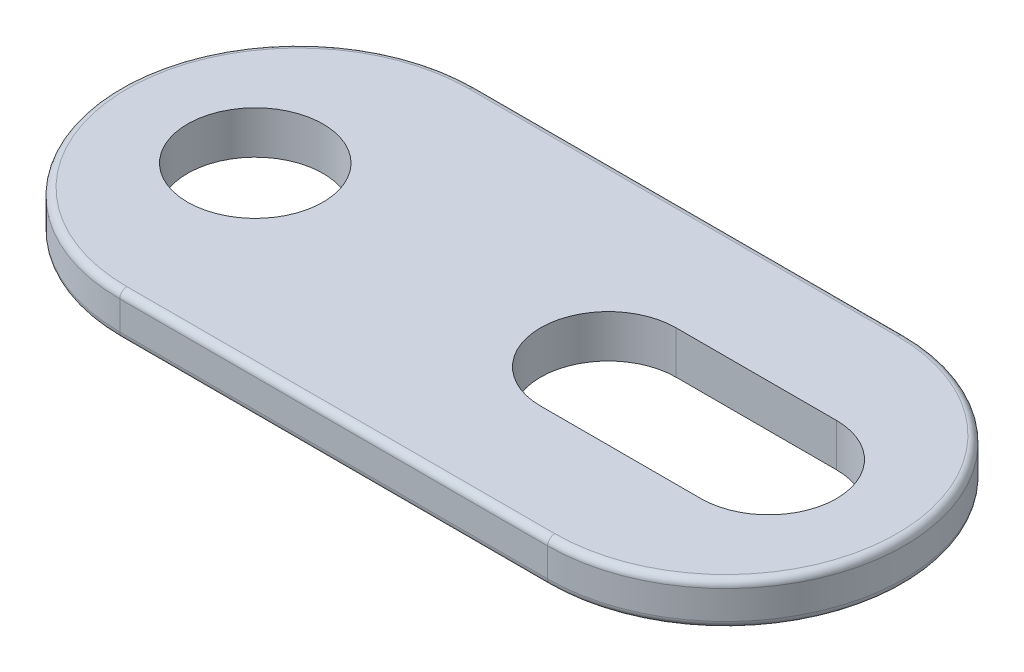
ISO-10303-21;
HEADER;
FILE_DESCRIPTION(('STEP AP214'),'2;1');
FILE_NAME('part.step','',(''),(''),'','','');
FILE_SCHEMA(('AUTOMOTIVE_DESIGN { 1 0 10303 214 1 1 1 1 }'));
ENDSEC;
DATA;
#1=APPLICATION_CONTEXT('core data for automotive mechanical design processes');
#2=APPLICATION_PROTOCOL_DEFINITION('international standard','automotive_design',2000,#1);
#3=PRODUCT_CONTEXT('',#1,'mechanical');
#4=PRODUCT('Part','Part','',(#3));
#5=PRODUCT_RELATED_PRODUCT_CATEGORY('part','',(#4));
#6=PRODUCT_DEFINITION_FORMATION('','',#4);
#7=PRODUCT_DEFINITION_CONTEXT('part definition',#1,'design');
#8=PRODUCT_DEFINITION('design','',#6,#7);
#9=PRODUCT_DEFINITION_SHAPE('','',#8);
#10=(LENGTH_UNIT() NAMED_UNIT(*) SI_UNIT(.MILLI.,.METRE.));
#11=(NAMED_UNIT(*) PLANE_ANGLE_UNIT() SI_UNIT($,.RADIAN.));
#12=(NAMED_UNIT(*) SI_UNIT($,.STERADIAN.) SOLID_ANGLE_UNIT());
#13=UNCERTAINTY_MEASURE_WITH_UNIT(LENGTH_MEASURE(1.E-05),#10,'distance_accuracy_value','');
#14=(GEOMETRIC_REPRESENTATION_CONTEXT(3) GLOBAL_UNCERTAINTY_ASSIGNED_CONTEXT((#13)) GLOBAL_UNIT_ASSIGNED_CONTEXT((#10,
#11,#12)) REPRESENTATION_CONTEXT('',''));
#15=CARTESIAN_POINT('',(0.,0.,0.));
#16=DIRECTION('',(0.,0.,1.));
#17=DIRECTION('',(1.,0.,0.));
#18=AXIS2_PLACEMENT_3D('',#15,#16,#17);
#19=CARTESIAN_POINT('',(1.524,0.762,0.));
#20=DIRECTION('',(0.,1.,0.));
#21=DIRECTION('',(0.,0.,1.));
#22=AXIS2_PLACEMENT_3D('',#19,#20,#21);
#23=PLANE('',#22);
#24=DIRECTION('',(-1.,0.,0.));
#25=VECTOR('',#24,1.);
#26=CARTESIAN_POINT('',(1.524,0.762,-6.096));
#27=LINE('',#26,#25);
#28=CARTESIAN_POINT('',(16.764,0.762,-6.096));
#29=VERTEX_POINT('',#28);
#30=CARTESIAN_POINT('',(1.524,0.762,-6.096));
#31=VERTEX_POINT('',#30);
#32=EDGE_CURVE('E53',#29,#31,#27,.T.);
#33=ORIENTED_EDGE('',*,*,#32,.T.);
#34=CARTESIAN_POINT('',(1.524,0.762,0.));
#35=DIRECTION('',(0.,1.,0.));
#36=DIRECTION('',(0.,0.,1.));
#37=AXIS2_PLACEMENT_3D('',#34,#35,#36);
#38=CIRCLE('',#37,6.096);
#39=CARTESIAN_POINT('',(1.524,0.762,6.096));
#40=VERTEX_POINT('',#39);
#41=EDGE_CURVE('E218',#31,#40,#38,.T.);
#42=ORIENTED_EDGE('',*,*,#41,.T.);
#43=DIRECTION('',(1.,0.,0.));
#44=VECTOR('',#43,1.);
#45=CARTESIAN_POINT('',(16.764,0.762,6.096));
#46=LINE('',#45,#44);
#47=CARTESIAN_POINT('',(16.764,0.762,6.096));
#48=VERTEX_POINT('',#47);
#49=EDGE_CURVE('E214',#40,#48,#46,.T.);
#50=ORIENTED_EDGE('',*,*,#49,.T.);
#51=CARTESIAN_POINT('',(16.764,0.762,0.));
#52=DIRECTION('',(0.,1.,0.));
#53=DIRECTION('',(0.,0.,1.));
#54=AXIS2_PLACEMENT_3D('',#51,#52,#53);
#55=CIRCLE('',#54,6.096);
#56=EDGE_CURVE('E58',#48,#29,#55,.T.);
#57=ORIENTED_EDGE('',*,*,#56,.T.);
#58=EDGE_LOOP('',(#33,#42,#50,#57));
#59=FACE_BOUND('',#58,.T.);
#60=CARTESIAN_POINT('',(0.,0.762,0.));
#61=DIRECTION('',(0.,1.,0.));
#62=DIRECTION('',(0.,0.,1.));
#63=AXIS2_PLACEMENT_3D('',#60,#61,#62);
#64=CIRCLE('',#63,2.413);
#65=CARTESIAN_POINT('',(0.,0.762,2.413));
#66=VERTEX_POINT('',#65);
#67=EDGE_CURVE('E176',#66,#66,#64,.T.);
#68=ORIENTED_EDGE('',*,*,#67,.F.);
#69=EDGE_LOOP('',(#68));
#70=FACE_BOUND('',#69,.T.);
#71=DIRECTION('',(1.,0.,0.));
#72=VECTOR('',#71,1.);
#73=CARTESIAN_POINT('',(12.573,0.762,2.413));
#74=LINE('',#73,#72);
#75=CARTESIAN_POINT('',(12.573,0.762,2.413));
#76=VERTEX_POINT('',#75);
#77=CARTESIAN_POINT('',(18.288,0.762,2.413));
#78=VERTEX_POINT('',#77);
#79=EDGE_CURVE('E162',#76,#78,#74,.T.);
#80=ORIENTED_EDGE('',*,*,#79,.F.);
#81=CARTESIAN_POINT('',(12.573,0.762,0.));
#82=DIRECTION('',(0.,1.,0.));
#83=DIRECTION('',(0.,0.,1.));
#84=AXIS2_PLACEMENT_3D('',#81,#82,#83);
#85=CIRCLE('',#84,2.413);
#86=CARTESIAN_POINT('',(12.573,0.762,-2.413));
#87=VERTEX_POINT('',#86);
#88=EDGE_CURVE('E145',#87,#76,#85,.T.);
#89=ORIENTED_EDGE('',*,*,#88,.F.);
#90=DIRECTION('',(-1.,0.,0.));
#91=VECTOR('',#90,1.);
#92=CARTESIAN_POINT('',(12.573,0.762,-2.413));
#93=LINE('',#92,#91);
#94=CARTESIAN_POINT('',(18.288,0.762,-2.413));
#95=VERTEX_POINT('',#94);
#96=EDGE_CURVE('E167',#95,#87,#93,.T.);
#97=ORIENTED_EDGE('',*,*,#96,.F.);
#98=CARTESIAN_POINT('',(18.288,0.762,0.));
#99=DIRECTION('',(0.,1.,0.));
#100=DIRECTION('',(0.,0.,1.));
#101=AXIS2_PLACEMENT_3D('',#98,#99,#100);
#102=CIRCLE('',#101,2.413);
#103=EDGE_CURVE('E164',#78,#95,#102,.T.);
#104=ORIENTED_EDGE('',*,*,#103,.F.);
#105=EDGE_LOOP('',(#80,#89,#97,#104));
#106=FACE_BOUND('',#105,.T.);
#107=ADVANCED_FACE('F38',(#59,#70,#106),#23,.T.);
#108=CARTESIAN_POINT('',(1.524,-0.762,0.));
#109=DIRECTION('',(0.,1.,0.));
#110=DIRECTION('',(0.,0.,1.));
#111=AXIS2_PLACEMENT_3D('',#108,#109,#110);
#112=PLANE('',#111);
#113=DIRECTION('',(1.,0.,0.));
#114=VECTOR('',#113,1.);
#115=CARTESIAN_POINT('',(1.524,-0.762,6.096));
#116=LINE('',#115,#114);
#117=CARTESIAN_POINT('',(16.764,-0.762,6.096));
#118=VERTEX_POINT('',#117);
#119=CARTESIAN_POINT('',(1.524,-0.762,6.096));
#120=VERTEX_POINT('',#119);
#121=EDGE_CURVE('E197',#118,#120,#116,.F.);
#122=ORIENTED_EDGE('',*,*,#121,.T.);
#123=CARTESIAN_POINT('',(1.524,-0.762,0.));
#124=DIRECTION('',(0.,1.,0.));
#125=DIRECTION('',(0.,0.,1.));
#126=AXIS2_PLACEMENT_3D('',#123,#124,#125);
#127=CIRCLE('',#126,6.096);
#128=CARTESIAN_POINT('',(1.524,-0.762,-6.096));
#129=VERTEX_POINT('',#128);
#130=EDGE_CURVE('E203',#120,#129,#127,.F.);
#131=ORIENTED_EDGE('',*,*,#130,.T.);
#132=DIRECTION('',(-1.,0.,0.));
#133=VECTOR('',#132,1.);
#134=CARTESIAN_POINT('',(1.524,-0.762,-6.096));
#135=LINE('',#134,#133);
#136=CARTESIAN_POINT('',(16.764,-0.762,-6.096));
#137=VERTEX_POINT('',#136);
#138=EDGE_CURVE('E201',#129,#137,#135,.F.);
#139=ORIENTED_EDGE('',*,*,#138,.T.);
#140=CARTESIAN_POINT('',(16.764,-0.762,0.));
#141=DIRECTION('',(0.,1.,0.));
#142=DIRECTION('',(0.,0.,1.));
#143=AXIS2_PLACEMENT_3D('',#140,#141,#142);
#144=CIRCLE('',#143,6.096);
#145=EDGE_CURVE('E199',#137,#118,#144,.F.);
#146=ORIENTED_EDGE('',*,*,#145,.T.);
#147=EDGE_LOOP('',(#122,#131,#139,#146));
#148=FACE_BOUND('',#147,.T.);
#149=CARTESIAN_POINT('',(0.,-0.762,0.));
#150=DIRECTION('',(0.,1.,0.));
#151=DIRECTION('',(0.,0.,1.));
#152=AXIS2_PLACEMENT_3D('',#149,#150,#151);
#153=CIRCLE('',#152,2.413);
#154=CARTESIAN_POINT('',(0.,-0.762,2.413));
#155=VERTEX_POINT('',#154);
#156=EDGE_CURVE('E146',#155,#155,#153,.T.);
#157=ORIENTED_EDGE('',*,*,#156,.T.);
#158=EDGE_LOOP('',(#157));
#159=FACE_BOUND('',#158,.T.);
#160=CARTESIAN_POINT('',(12.573,-0.762,0.));
#161=DIRECTION('',(0.,1.,0.));
#162=DIRECTION('',(0.,0.,1.));
#163=AXIS2_PLACEMENT_3D('',#160,#161,#162);
#164=CIRCLE('',#163,2.413);
#165=CARTESIAN_POINT('',(12.573,-0.762,-2.413));
#166=VERTEX_POINT('',#165);
#167=CARTESIAN_POINT('',(12.573,-0.762,2.413));
#168=VERTEX_POINT('',#167);
#169=EDGE_CURVE('E138',#166,#168,#164,.T.);
#170=ORIENTED_EDGE('',*,*,#169,.T.);
#171=DIRECTION('',(1.,0.,0.));
#172=VECTOR('',#171,1.);
#173=CARTESIAN_POINT('',(12.573,-0.762,2.413));
#174=LINE('',#173,#172);
#175=CARTESIAN_POINT('',(18.288,-0.762,2.413));
#176=VERTEX_POINT('',#175);
#177=EDGE_CURVE('E126',#168,#176,#174,.T.);
#178=ORIENTED_EDGE('',*,*,#177,.T.);
#179=CARTESIAN_POINT('',(18.288,-0.762,0.));
#180=DIRECTION('',(0.,1.,0.));
#181=DIRECTION('',(0.,0.,1.));
#182=AXIS2_PLACEMENT_3D('',#179,#180,#181);
#183=CIRCLE('',#182,2.413);
#184=CARTESIAN_POINT('',(18.288,-0.762,-2.413));
#185=VERTEX_POINT('',#184);
#186=EDGE_CURVE('E137',#176,#185,#183,.T.);
#187=ORIENTED_EDGE('',*,*,#186,.T.);
#188=DIRECTION('',(-1.,0.,0.));
#189=VECTOR('',#188,1.);
#190=CARTESIAN_POINT('',(12.573,-0.762,-2.413));
#191=LINE('',#190,#189);
#192=EDGE_CURVE('E151',#185,#166,#191,.T.);
#193=ORIENTED_EDGE('',*,*,#192,.T.);
#194=EDGE_LOOP('',(#170,#178,#187,#193));
#195=FACE_BOUND('',#194,.T.);
#196=ADVANCED_FACE('F149',(#148,#159,#195),#112,.F.);
#197=CARTESIAN_POINT('',(1.524,0.762,0.));
#198=DIRECTION('',(0.,-1.,0.));
#199=DIRECTION('',(0.,0.,-1.));
#200=AXIS2_PLACEMENT_3D('',#197,#198,#199);
#201=CYLINDRICAL_SURFACE('',#200,6.35);
#202=DIRECTION('',(0.,-1.,0.));
#203=VECTOR('',#202,1.);
#204=CARTESIAN_POINT('',(1.524,0.762,-6.35));
#205=LINE('',#204,#203);
#206=CARTESIAN_POINT('',(1.524,0.508,-6.35));
#207=VERTEX_POINT('',#206);
#208=CARTESIAN_POINT('',(1.524,-0.507999999999999,-6.35));
#209=VERTEX_POINT('',#208);
#210=EDGE_CURVE('E179',#207,#209,#205,.T.);
#211=ORIENTED_EDGE('',*,*,#210,.T.);
#212=CARTESIAN_POINT('',(1.524,-0.508,0.));
#213=DIRECTION('',(0.,1.,0.));
#214=DIRECTION('',(0.,0.,1.));
#215=AXIS2_PLACEMENT_3D('',#212,#213,#214);
#216=CIRCLE('',#215,6.35);
#217=CARTESIAN_POINT('',(1.524,-0.507999999999999,6.35));
#218=VERTEX_POINT('',#217);
#219=EDGE_CURVE('E194',#209,#218,#216,.T.);
#220=ORIENTED_EDGE('',*,*,#219,.T.);
#221=DIRECTION('',(0.,-1.,0.));
#222=VECTOR('',#221,1.);
#223=CARTESIAN_POINT('',(1.524,0.762,6.35));
#224=LINE('',#223,#222);
#225=CARTESIAN_POINT('',(1.524,0.508,6.35));
#226=VERTEX_POINT('',#225);
#227=EDGE_CURVE('E188',#226,#218,#224,.T.);
#228=ORIENTED_EDGE('',*,*,#227,.F.);
#229=CARTESIAN_POINT('',(1.524,0.508,0.));
#230=DIRECTION('',(0.,1.,0.));
#231=DIRECTION('',(0.,0.,1.));
#232=AXIS2_PLACEMENT_3D('',#229,#230,#231);
#233=CIRCLE('',#232,6.35);
#234=EDGE_CURVE('E191',#226,#207,#233,.F.);
#235=ORIENTED_EDGE('',*,*,#234,.T.);
#236=EDGE_LOOP('',(#211,#220,#228,#235));
#237=FACE_BOUND('',#236,.T.);
#238=ADVANCED_FACE('F40',(#237),#201,.T.);
#239=CARTESIAN_POINT('',(1.524,0.762,6.35));
#240=DIRECTION('',(0.,0.,-1.));
#241=DIRECTION('',(-1.,0.,0.));
#242=AXIS2_PLACEMENT_3D('',#239,#240,#241);
#243=PLANE('',#242);
#244=ORIENTED_EDGE('',*,*,#227,.T.);
#245=DIRECTION('',(1.,0.,0.));
#246=VECTOR('',#245,1.);
#247=CARTESIAN_POINT('',(1.524,-0.508,6.35));
#248=LINE('',#247,#246);
#249=CARTESIAN_POINT('',(16.764,-0.507999999999999,6.35));
#250=VERTEX_POINT('',#249);
#251=EDGE_CURVE('E11',#218,#250,#248,.T.);
#252=ORIENTED_EDGE('',*,*,#251,.T.);
#253=DIRECTION('',(0.,-1.,0.));
#254=VECTOR('',#253,1.);
#255=CARTESIAN_POINT('',(16.764,0.762,6.35));
#256=LINE('',#255,#254);
#257=CARTESIAN_POINT('',(16.764,0.508,6.35));
#258=VERTEX_POINT('',#257);
#259=EDGE_CURVE('E185',#258,#250,#256,.T.);
#260=ORIENTED_EDGE('',*,*,#259,.F.);
#261=DIRECTION('',(1.,0.,0.));
#262=VECTOR('',#261,1.);
#263=CARTESIAN_POINT('',(1.524,0.508,6.35));
#264=LINE('',#263,#262);
#265=EDGE_CURVE('E46',#258,#226,#264,.F.);
#266=ORIENTED_EDGE('',*,*,#265,.T.);
#267=EDGE_LOOP('',(#244,#252,#260,#266));
#268=FACE_BOUND('',#267,.T.);
#269=ADVANCED_FACE('F223',(#268),#243,.F.);
#270=CARTESIAN_POINT('',(16.764,0.762,0.));
#271=DIRECTION('',(0.,-1.,0.));
#272=DIRECTION('',(0.,0.,-1.));
#273=AXIS2_PLACEMENT_3D('',#270,#271,#272);
#274=CYLINDRICAL_SURFACE('',#273,6.35);
#275=ORIENTED_EDGE('',*,*,#259,.T.);
#276=CARTESIAN_POINT('',(16.764,-0.508,0.));
#277=DIRECTION('',(0.,1.,0.));
#278=DIRECTION('',(0.,0.,1.));
#279=AXIS2_PLACEMENT_3D('',#276,#277,#278);
#280=CIRCLE('',#279,6.35);
#281=CARTESIAN_POINT('',(16.764,-0.507999999999999,-6.35));
#282=VERTEX_POINT('',#281);
#283=EDGE_CURVE('E212',#250,#282,#280,.T.);
#284=ORIENTED_EDGE('',*,*,#283,.T.);
#285=DIRECTION('',(0.,-1.,0.));
#286=VECTOR('',#285,1.);
#287=CARTESIAN_POINT('',(16.764,0.762,-6.35));
#288=LINE('',#287,#286);
#289=CARTESIAN_POINT('',(16.764,0.508,-6.35));
#290=VERTEX_POINT('',#289);
#291=EDGE_CURVE('E182',#290,#282,#288,.T.);
#292=ORIENTED_EDGE('',*,*,#291,.F.);
#293=CARTESIAN_POINT('',(16.764,0.508,0.));
#294=DIRECTION('',(0.,1.,0.));
#295=DIRECTION('',(0.,0.,1.));
#296=AXIS2_PLACEMENT_3D('',#293,#294,#295);
#297=CIRCLE('',#296,6.35);
#298=EDGE_CURVE('E210',#290,#258,#297,.F.);
#299=ORIENTED_EDGE('',*,*,#298,.T.);
#300=EDGE_LOOP('',(#275,#284,#292,#299));
#301=FACE_BOUND('',#300,.T.);
#302=ADVANCED_FACE('F266',(#301),#274,.T.);
#303=CARTESIAN_POINT('',(1.524,0.762,-6.35));
#304=DIRECTION('',(0.,0.,1.));
#305=DIRECTION('',(1.,0.,0.));
#306=AXIS2_PLACEMENT_3D('',#303,#304,#305);
#307=PLANE('',#306);
#308=ORIENTED_EDGE('',*,*,#291,.T.);
#309=DIRECTION('',(-1.,0.,0.));
#310=VECTOR('',#309,1.);
#311=CARTESIAN_POINT('',(1.524,-0.508,-6.35));
#312=LINE('',#311,#310);
#313=EDGE_CURVE('E208',#282,#209,#312,.T.);
#314=ORIENTED_EDGE('',*,*,#313,.T.);
#315=ORIENTED_EDGE('',*,*,#210,.F.);
#316=DIRECTION('',(-1.,0.,0.));
#317=VECTOR('',#316,1.);
#318=CARTESIAN_POINT('',(16.764,0.508,-6.35));
#319=LINE('',#318,#317);
#320=EDGE_CURVE('E206',#207,#290,#319,.F.);
#321=ORIENTED_EDGE('',*,*,#320,.T.);
#322=EDGE_LOOP('',(#308,#314,#315,#321));
#323=FACE_BOUND('',#322,.T.);
#324=ADVANCED_FACE('F269',(#323),#307,.F.);
#325=CARTESIAN_POINT('',(0.,0.762,0.));
#326=DIRECTION('',(0.,-1.,0.));
#327=DIRECTION('',(0.,0.,-1.));
#328=AXIS2_PLACEMENT_3D('',#325,#326,#327);
#329=CYLINDRICAL_SURFACE('',#328,2.413);
#330=ORIENTED_EDGE('',*,*,#67,.T.);
#331=EDGE_LOOP('',(#330));
#332=FACE_BOUND('',#331,.T.);
#333=ORIENTED_EDGE('',*,*,#156,.F.);
#334=EDGE_LOOP('',(#333));
#335=FACE_BOUND('',#334,.T.);
#336=ADVANCED_FACE('F296',(#332,#335),#329,.F.);
#337=CARTESIAN_POINT('',(12.573,0.762,0.));
#338=DIRECTION('',(0.,-1.,0.));
#339=DIRECTION('',(0.,0.,-1.));
#340=AXIS2_PLACEMENT_3D('',#337,#338,#339);
#341=CYLINDRICAL_SURFACE('',#340,2.413);
#342=ORIENTED_EDGE('',*,*,#169,.F.);
#343=DIRECTION('',(0.,-1.,0.));
#344=VECTOR('',#343,1.);
#345=CARTESIAN_POINT('',(12.573,0.762,-2.413));
#346=LINE('',#345,#344);
#347=EDGE_CURVE('E169',#87,#166,#346,.T.);
#348=ORIENTED_EDGE('',*,*,#347,.F.);
#349=ORIENTED_EDGE('',*,*,#88,.T.);
#350=DIRECTION('',(0.,-1.,0.));
#351=VECTOR('',#350,1.);
#352=CARTESIAN_POINT('',(12.573,0.762,2.413));
#353=LINE('',#352,#351);
#354=EDGE_CURVE('E129',#76,#168,#353,.T.);
#355=ORIENTED_EDGE('',*,*,#354,.T.);
#356=EDGE_LOOP('',(#342,#348,#349,#355));
#357=FACE_BOUND('',#356,.T.);
#358=ADVANCED_FACE('F141',(#357),#341,.F.);
#359=CARTESIAN_POINT('',(12.573,0.762,2.413));
#360=DIRECTION('',(0.,0.,-1.));
#361=DIRECTION('',(-1.,0.,0.));
#362=AXIS2_PLACEMENT_3D('',#359,#360,#361);
#363=PLANE('',#362);
#364=ORIENTED_EDGE('',*,*,#177,.F.);
#365=ORIENTED_EDGE('',*,*,#354,.F.);
#366=ORIENTED_EDGE('',*,*,#79,.T.);
#367=DIRECTION('',(0.,-1.,0.));
#368=VECTOR('',#367,1.);
#369=CARTESIAN_POINT('',(18.288,0.762,2.413));
#370=LINE('',#369,#368);
#371=EDGE_CURVE('E132',#78,#176,#370,.T.);
#372=ORIENTED_EDGE('',*,*,#371,.T.);
#373=EDGE_LOOP('',(#364,#365,#366,#372));
#374=FACE_BOUND('',#373,.T.);
#375=ADVANCED_FACE('F128',(#374),#363,.T.);
#376=CARTESIAN_POINT('',(18.288,0.762,0.));
#377=DIRECTION('',(0.,-1.,0.));
#378=DIRECTION('',(0.,0.,-1.));
#379=AXIS2_PLACEMENT_3D('',#376,#377,#378);
#380=CYLINDRICAL_SURFACE('',#379,2.413);
#381=ORIENTED_EDGE('',*,*,#186,.F.);
#382=ORIENTED_EDGE('',*,*,#371,.F.);
#383=ORIENTED_EDGE('',*,*,#103,.T.);
#384=DIRECTION('',(0.,-1.,0.));
#385=VECTOR('',#384,1.);
#386=CARTESIAN_POINT('',(18.288,0.762,-2.413));
#387=LINE('',#386,#385);
#388=EDGE_CURVE('E171',#95,#185,#387,.T.);
#389=ORIENTED_EDGE('',*,*,#388,.T.);
#390=EDGE_LOOP('',(#381,#382,#383,#389));
#391=FACE_BOUND('',#390,.T.);
#392=ADVANCED_FACE('F322',(#391),#380,.F.);
#393=CARTESIAN_POINT('',(12.573,0.762,-2.413));
#394=DIRECTION('',(0.,0.,1.));
#395=DIRECTION('',(1.,0.,0.));
#396=AXIS2_PLACEMENT_3D('',#393,#394,#395);
#397=PLANE('',#396);
#398=ORIENTED_EDGE('',*,*,#192,.F.);
#399=ORIENTED_EDGE('',*,*,#388,.F.);
#400=ORIENTED_EDGE('',*,*,#96,.T.);
#401=ORIENTED_EDGE('',*,*,#347,.T.);
#402=EDGE_LOOP('',(#398,#399,#400,#401));
#403=FACE_BOUND('',#402,.T.);
#404=ADVANCED_FACE('F317',(#403),#397,.T.);
#405=CARTESIAN_POINT('',(16.764,-0.508,0.));
#406=DIRECTION('',(0.,1.,0.));
#407=DIRECTION('',(0.,0.,1.));
#408=AXIS2_PLACEMENT_3D('',#405,#406,#407);
#409=TOROIDAL_SURFACE('',#408,6.096,0.254);
#410=CARTESIAN_POINT('',(16.764,-0.508,6.096));
#411=DIRECTION('',(-1.,0.,0.));
#412=DIRECTION('',(0.,0.,1.));
#413=AXIS2_PLACEMENT_3D('',#410,#411,#412);
#414=CIRCLE('',#413,0.254);
#415=EDGE_CURVE('E155',#118,#250,#414,.T.);
#416=ORIENTED_EDGE('',*,*,#415,.F.);
#417=ORIENTED_EDGE('',*,*,#145,.F.);
#418=CARTESIAN_POINT('',(16.764,-0.508,-6.096));
#419=DIRECTION('',(-1.,0.,0.));
#420=DIRECTION('',(0.,0.,1.));
#421=AXIS2_PLACEMENT_3D('',#418,#419,#420);
#422=CIRCLE('',#421,0.254);
#423=EDGE_CURVE('E152',#282,#137,#422,.T.);
#424=ORIENTED_EDGE('',*,*,#423,.F.);
#425=ORIENTED_EDGE('',*,*,#283,.F.);
#426=EDGE_LOOP('',(#416,#417,#424,#425));
#427=FACE_BOUND('',#426,.T.);
#428=ADVANCED_FACE('F261',(#427),#409,.T.);
#429=CARTESIAN_POINT('',(1.524,-0.508,-6.096));
#430=DIRECTION('',(-1.,0.,0.));
#431=DIRECTION('',(0.,0.,1.));
#432=AXIS2_PLACEMENT_3D('',#429,#430,#431);
#433=CYLINDRICAL_SURFACE('',#432,0.254);
#434=ORIENTED_EDGE('',*,*,#423,.T.);
#435=ORIENTED_EDGE('',*,*,#138,.F.);
#436=CARTESIAN_POINT('',(1.524,-0.508,-6.096));
#437=DIRECTION('',(-1.,0.,0.));
#438=DIRECTION('',(0.,0.,1.));
#439=AXIS2_PLACEMENT_3D('',#436,#437,#438);
#440=CIRCLE('',#439,0.254);
#441=EDGE_CURVE('E250',#209,#129,#440,.T.);
#442=ORIENTED_EDGE('',*,*,#441,.F.);
#443=ORIENTED_EDGE('',*,*,#313,.F.);
#444=EDGE_LOOP('',(#434,#435,#442,#443));
#445=FACE_BOUND('',#444,.T.);
#446=ADVANCED_FACE('F383',(#445),#433,.T.);
#447=CARTESIAN_POINT('',(1.524,-0.508,6.096));
#448=DIRECTION('',(1.,0.,0.));
#449=DIRECTION('',(0.,0.,-1.));
#450=AXIS2_PLACEMENT_3D('',#447,#448,#449);
#451=CYLINDRICAL_SURFACE('',#450,0.254);
#452=ORIENTED_EDGE('',*,*,#415,.T.);
#453=ORIENTED_EDGE('',*,*,#251,.F.);
#454=CARTESIAN_POINT('',(1.524,-0.508,6.096));
#455=DIRECTION('',(-1.,0.,0.));
#456=DIRECTION('',(0.,0.,1.));
#457=AXIS2_PLACEMENT_3D('',#454,#455,#456);
#458=CIRCLE('',#457,0.254);
#459=EDGE_CURVE('E248',#120,#218,#458,.T.);
#460=ORIENTED_EDGE('',*,*,#459,.F.);
#461=ORIENTED_EDGE('',*,*,#121,.F.);
#462=EDGE_LOOP('',(#452,#453,#460,#461));
#463=FACE_BOUND('',#462,.T.);
#464=ADVANCED_FACE('F256',(#463),#451,.T.);
#465=CARTESIAN_POINT('',(1.524,-0.508,0.));
#466=DIRECTION('',(0.,1.,0.));
#467=DIRECTION('',(0.,0.,1.));
#468=AXIS2_PLACEMENT_3D('',#465,#466,#467);
#469=TOROIDAL_SURFACE('',#468,6.096,0.254);
#470=ORIENTED_EDGE('',*,*,#441,.T.);
#471=ORIENTED_EDGE('',*,*,#130,.F.);
#472=ORIENTED_EDGE('',*,*,#459,.T.);
#473=ORIENTED_EDGE('',*,*,#219,.F.);
#474=EDGE_LOOP('',(#470,#471,#472,#473));
#475=FACE_BOUND('',#474,.T.);
#476=ADVANCED_FACE('F275',(#475),#469,.T.);
#477=CARTESIAN_POINT('',(16.764,0.508,0.));
#478=DIRECTION('',(0.,1.,0.));
#479=DIRECTION('',(0.,0.,1.));
#480=AXIS2_PLACEMENT_3D('',#477,#478,#479);
#481=TOROIDAL_SURFACE('',#480,6.096,0.254);
#482=CARTESIAN_POINT('',(16.764,0.508,6.096));
#483=DIRECTION('',(-1.,0.,0.));
#484=DIRECTION('',(0.,0.,1.));
#485=AXIS2_PLACEMENT_3D('',#482,#483,#484);
#486=CIRCLE('',#485,0.254);
#487=EDGE_CURVE('E241',#258,#48,#486,.T.);
#488=ORIENTED_EDGE('',*,*,#487,.F.);
#489=ORIENTED_EDGE('',*,*,#298,.F.);
#490=CARTESIAN_POINT('',(16.764,0.508,-6.096));
#491=DIRECTION('',(-1.,0.,0.));
#492=DIRECTION('',(0.,0.,1.));
#493=AXIS2_PLACEMENT_3D('',#490,#491,#492);
#494=CIRCLE('',#493,0.254);
#495=EDGE_CURVE('E245',#29,#290,#494,.T.);
#496=ORIENTED_EDGE('',*,*,#495,.F.);
#497=ORIENTED_EDGE('',*,*,#56,.F.);
#498=EDGE_LOOP('',(#488,#489,#496,#497));
#499=FACE_BOUND('',#498,.T.);
#500=ADVANCED_FACE('F273',(#499),#481,.T.);
#501=CARTESIAN_POINT('',(1.524,0.508,-6.096));
#502=DIRECTION('',(1.,0.,0.));
#503=DIRECTION('',(0.,0.,-1.));
#504=AXIS2_PLACEMENT_3D('',#501,#502,#503);
#505=CYLINDRICAL_SURFACE('',#504,0.254);
#506=ORIENTED_EDGE('',*,*,#495,.T.);
#507=ORIENTED_EDGE('',*,*,#320,.F.);
#508=CARTESIAN_POINT('',(1.524,0.508,-6.096));
#509=DIRECTION('',(-1.,0.,0.));
#510=DIRECTION('',(0.,0.,1.));
#511=AXIS2_PLACEMENT_3D('',#508,#509,#510);
#512=CIRCLE('',#511,0.254);
#513=EDGE_CURVE('E237',#31,#207,#512,.T.);
#514=ORIENTED_EDGE('',*,*,#513,.F.);
#515=ORIENTED_EDGE('',*,*,#32,.F.);
#516=EDGE_LOOP('',(#506,#507,#514,#515));
#517=FACE_BOUND('',#516,.T.);
#518=ADVANCED_FACE('F271',(#517),#505,.T.);
#519=CARTESIAN_POINT('',(1.524,0.508,6.096));
#520=DIRECTION('',(-1.,0.,0.));
#521=DIRECTION('',(0.,0.,1.));
#522=AXIS2_PLACEMENT_3D('',#519,#520,#521);
#523=CYLINDRICAL_SURFACE('',#522,0.254);
#524=ORIENTED_EDGE('',*,*,#487,.T.);
#525=ORIENTED_EDGE('',*,*,#49,.F.);
#526=CARTESIAN_POINT('',(1.524,0.508,6.096));
#527=DIRECTION('',(-1.,0.,0.));
#528=DIRECTION('',(0.,0.,1.));
#529=AXIS2_PLACEMENT_3D('',#526,#527,#528);
#530=CIRCLE('',#529,0.254);
#531=EDGE_CURVE('E235',#226,#40,#530,.T.);
#532=ORIENTED_EDGE('',*,*,#531,.F.);
#533=ORIENTED_EDGE('',*,*,#265,.F.);
#534=EDGE_LOOP('',(#524,#525,#532,#533));
#535=FACE_BOUND('',#534,.T.);
#536=ADVANCED_FACE('F239',(#535),#523,.T.);
#537=CARTESIAN_POINT('',(1.524,0.508,0.));
#538=DIRECTION('',(0.,1.,0.));
#539=DIRECTION('',(0.,0.,1.));
#540=AXIS2_PLACEMENT_3D('',#537,#538,#539);
#541=TOROIDAL_SURFACE('',#540,6.096,0.254);
#542=ORIENTED_EDGE('',*,*,#513,.T.);
#543=ORIENTED_EDGE('',*,*,#234,.F.);
#544=ORIENTED_EDGE('',*,*,#531,.T.);
#545=ORIENTED_EDGE('',*,*,#41,.F.);
#546=EDGE_LOOP('',(#542,#543,#544,#545));
#547=FACE_BOUND('',#546,.T.);
#548=ADVANCED_FACE('F233',(#547),#541,.T.);
#549=CLOSED_SHELL('',(#107,#196,#238,#269,#302,#324,#336,#358,#375,#392,#404,#428,#446,#464,
#476,#500,#518,#536,#548));
#550=MANIFOLD_SOLID_BREP('B2',#549);
#551=ADVANCED_BREP_SHAPE_REPRESENTATION('',(#18,#550),#14);
#552=SHAPE_DEFINITION_REPRESENTATION(#9,#551);
ENDSEC;
END-ISO-10303-21;
